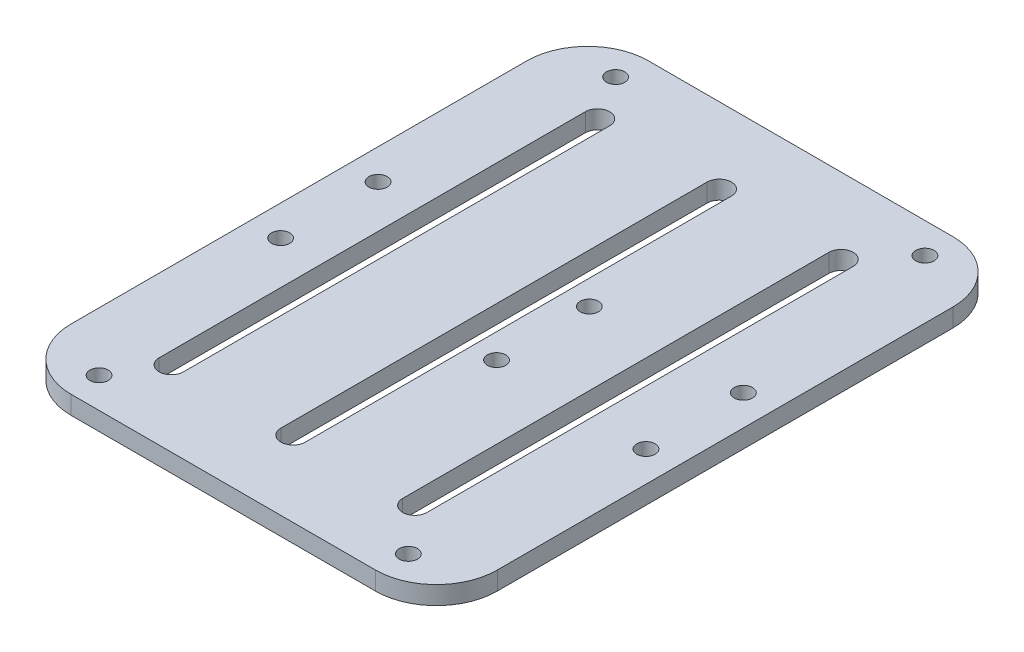
ISO-10303-21;
HEADER;
FILE_DESCRIPTION(('STEP AP214'),'2;1');
FILE_NAME('part.step','',(''),(''),'','','');
FILE_SCHEMA(('AUTOMOTIVE_DESIGN { 1 0 10303 214 1 1 1 1 }'));
ENDSEC;
DATA;
#1=APPLICATION_CONTEXT('core data for automotive mechanical design processes');
#2=APPLICATION_PROTOCOL_DEFINITION('international standard','automotive_design',2000,#1);
#3=PRODUCT_CONTEXT('',#1,'mechanical');
#4=PRODUCT('Part','Part','',(#3));
#5=PRODUCT_RELATED_PRODUCT_CATEGORY('part','',(#4));
#6=PRODUCT_DEFINITION_FORMATION('','',#4);
#7=PRODUCT_DEFINITION_CONTEXT('part definition',#1,'design');
#8=PRODUCT_DEFINITION('design','',#6,#7);
#9=PRODUCT_DEFINITION_SHAPE('','',#8);
#10=(LENGTH_UNIT() NAMED_UNIT(*) SI_UNIT(.MILLI.,.METRE.));
#11=(NAMED_UNIT(*) PLANE_ANGLE_UNIT() SI_UNIT($,.RADIAN.));
#12=(NAMED_UNIT(*) SI_UNIT($,.STERADIAN.) SOLID_ANGLE_UNIT());
#13=UNCERTAINTY_MEASURE_WITH_UNIT(LENGTH_MEASURE(1.E-05),#10,'distance_accuracy_value','');
#14=(GEOMETRIC_REPRESENTATION_CONTEXT(3) GLOBAL_UNCERTAINTY_ASSIGNED_CONTEXT((#13)) GLOBAL_UNIT_ASSIGNED_CONTEXT((#10,
#11,#12)) REPRESENTATION_CONTEXT('',''));
#15=CARTESIAN_POINT('',(0.,0.,0.));
#16=DIRECTION('',(0.,0.,1.));
#17=DIRECTION('',(1.,0.,0.));
#18=AXIS2_PLACEMENT_3D('',#15,#16,#17);
#19=CARTESIAN_POINT('',(-25.,3.,37.42));
#20=DIRECTION('',(0.,1.,0.));
#21=DIRECTION('',(0.,0.,1.));
#22=AXIS2_PLACEMENT_3D('',#19,#20,#21);
#23=PLANE('',#22);
#24=CARTESIAN_POINT('',(5.07999999999997,3.,7.62));
#25=DIRECTION('',(0.,1.,0.));
#26=DIRECTION('',(0.,0.,1.));
#27=AXIS2_PLACEMENT_3D('',#24,#25,#26);
#28=CIRCLE('',#27,1.5);
#29=CARTESIAN_POINT('',(5.07999999999997,3.,9.12));
#30=VERTEX_POINT('',#29);
#31=EDGE_CURVE('E212',#30,#30,#28,.T.);
#32=ORIENTED_EDGE('',*,*,#31,.F.);
#33=EDGE_LOOP('',(#32));
#34=FACE_BOUND('',#33,.T.);
#35=CARTESIAN_POINT('',(-25.4,3.,42.42));
#36=DIRECTION('',(0.,1.,0.));
#37=DIRECTION('',(0.,0.,1.));
#38=AXIS2_PLACEMENT_3D('',#35,#36,#37);
#39=CIRCLE('',#38,1.5);
#40=CARTESIAN_POINT('',(-25.4,3.,43.92));
#41=VERTEX_POINT('',#40);
#42=EDGE_CURVE('E322',#41,#41,#39,.T.);
#43=ORIENTED_EDGE('',*,*,#42,.F.);
#44=EDGE_LOOP('',(#43));
#45=FACE_BOUND('',#44,.T.);
#46=CARTESIAN_POINT('',(-25.4,3.,-42.42));
#47=DIRECTION('',(0.,1.,0.));
#48=DIRECTION('',(0.,0.,1.));
#49=AXIS2_PLACEMENT_3D('',#46,#47,#48);
#50=CIRCLE('',#49,1.5);
#51=CARTESIAN_POINT('',(-25.4,3.,-40.92));
#52=VERTEX_POINT('',#51);
#53=EDGE_CURVE('E338',#52,#52,#50,.T.);
#54=ORIENTED_EDGE('',*,*,#53,.F.);
#55=EDGE_LOOP('',(#54));
#56=FACE_BOUND('',#55,.T.);
#57=CARTESIAN_POINT('',(-30.,3.,8.));
#58=DIRECTION('',(0.,1.,0.));
#59=DIRECTION('',(0.,0.,1.));
#60=AXIS2_PLACEMENT_3D('',#57,#58,#59);
#61=CIRCLE('',#60,1.5);
#62=CARTESIAN_POINT('',(-30.,3.,9.5));
#63=VERTEX_POINT('',#62);
#64=EDGE_CURVE('E354',#63,#63,#61,.T.);
#65=ORIENTED_EDGE('',*,*,#64,.F.);
#66=EDGE_LOOP('',(#65));
#67=FACE_BOUND('',#66,.T.);
#68=CARTESIAN_POINT('',(-30.,3.,-8.));
#69=DIRECTION('',(0.,1.,0.));
#70=DIRECTION('',(0.,0.,1.));
#71=AXIS2_PLACEMENT_3D('',#68,#69,#70);
#72=CIRCLE('',#71,1.5);
#73=CARTESIAN_POINT('',(-30.,3.,-6.5));
#74=VERTEX_POINT('',#73);
#75=EDGE_CURVE('E370',#74,#74,#72,.T.);
#76=ORIENTED_EDGE('',*,*,#75,.F.);
#77=EDGE_LOOP('',(#76));
#78=FACE_BOUND('',#77,.T.);
#79=CARTESIAN_POINT('',(-25.,3.,37.42));
#80=DIRECTION('',(0.,1.,0.));
#81=DIRECTION('',(0.,0.,1.));
#82=AXIS2_PLACEMENT_3D('',#79,#80,#81);
#83=CIRCLE('',#82,10.);
#84=CARTESIAN_POINT('',(-35.,3.,37.4199999999999));
#85=VERTEX_POINT('',#84);
#86=CARTESIAN_POINT('',(-25.,3.,47.42));
#87=VERTEX_POINT('',#86);
#88=EDGE_CURVE('E378',#85,#87,#83,.T.);
#89=ORIENTED_EDGE('',*,*,#88,.T.);
#90=DIRECTION('',(1.,0.,0.));
#91=VECTOR('',#90,1.);
#92=CARTESIAN_POINT('',(-25.,3.,47.42));
#93=LINE('',#92,#91);
#94=CARTESIAN_POINT('',(24.9999999999999,3.,47.42));
#95=VERTEX_POINT('',#94);
#96=EDGE_CURVE('E382',#87,#95,#93,.T.);
#97=ORIENTED_EDGE('',*,*,#96,.T.);
#98=CARTESIAN_POINT('',(25.,3.,37.42));
#99=DIRECTION('',(0.,1.,0.));
#100=DIRECTION('',(0.,0.,1.));
#101=AXIS2_PLACEMENT_3D('',#98,#99,#100);
#102=CIRCLE('',#101,10.);
#103=CARTESIAN_POINT('',(35.,3.,37.4199999999999));
#104=VERTEX_POINT('',#103);
#105=EDGE_CURVE('E386',#95,#104,#102,.T.);
#106=ORIENTED_EDGE('',*,*,#105,.T.);
#107=DIRECTION('',(0.,0.,-1.));
#108=VECTOR('',#107,1.);
#109=CARTESIAN_POINT('',(35.,3.,-37.4199999999999));
#110=LINE('',#109,#108);
#111=CARTESIAN_POINT('',(35.,3.,-37.4199999999999));
#112=VERTEX_POINT('',#111);
#113=EDGE_CURVE('E389',#104,#112,#110,.T.);
#114=ORIENTED_EDGE('',*,*,#113,.T.);
#115=CARTESIAN_POINT('',(25.,3.,-37.42));
#116=DIRECTION('',(0.,1.,0.));
#117=DIRECTION('',(0.,0.,1.));
#118=AXIS2_PLACEMENT_3D('',#115,#116,#117);
#119=CIRCLE('',#118,10.);
#120=CARTESIAN_POINT('',(24.9999999999999,3.,-47.42));
#121=VERTEX_POINT('',#120);
#122=EDGE_CURVE('E392',#112,#121,#119,.T.);
#123=ORIENTED_EDGE('',*,*,#122,.T.);
#124=DIRECTION('',(-1.,0.,0.));
#125=VECTOR('',#124,1.);
#126=CARTESIAN_POINT('',(-25.,3.,-47.42));
#127=LINE('',#126,#125);
#128=CARTESIAN_POINT('',(-25.,3.,-47.42));
#129=VERTEX_POINT('',#128);
#130=EDGE_CURVE('E395',#121,#129,#127,.T.);
#131=ORIENTED_EDGE('',*,*,#130,.T.);
#132=CARTESIAN_POINT('',(-25.,3.,-37.42));
#133=DIRECTION('',(0.,1.,0.));
#134=DIRECTION('',(0.,0.,-1.));
#135=AXIS2_PLACEMENT_3D('',#132,#133,#134);
#136=CIRCLE('',#135,10.);
#137=CARTESIAN_POINT('',(-35.,3.,-37.4199999999999));
#138=VERTEX_POINT('',#137);
#139=EDGE_CURVE('E398',#129,#138,#136,.T.);
#140=ORIENTED_EDGE('',*,*,#139,.T.);
#141=DIRECTION('',(0.,0.,1.));
#142=VECTOR('',#141,1.);
#143=CARTESIAN_POINT('',(-35.,3.,-37.4199999999999));
#144=LINE('',#143,#142);
#145=EDGE_CURVE('E401',#138,#85,#144,.T.);
#146=ORIENTED_EDGE('',*,*,#145,.T.);
#147=EDGE_LOOP('',(#89,#97,#106,#114,#123,#131,#140,#146));
#148=FACE_BOUND('',#147,.T.);
#149=CARTESIAN_POINT('',(30.,3.,-8.));
#150=DIRECTION('',(0.,1.,0.));
#151=DIRECTION('',(0.,0.,1.));
#152=AXIS2_PLACEMENT_3D('',#149,#150,#151);
#153=CIRCLE('',#152,1.5);
#154=CARTESIAN_POINT('',(30.,3.,-6.5));
#155=VERTEX_POINT('',#154);
#156=EDGE_CURVE('E362',#155,#155,#153,.T.);
#157=ORIENTED_EDGE('',*,*,#156,.F.);
#158=EDGE_LOOP('',(#157));
#159=FACE_BOUND('',#158,.T.);
#160=CARTESIAN_POINT('',(30.,3.,8.));
#161=DIRECTION('',(0.,1.,0.));
#162=DIRECTION('',(0.,0.,1.));
#163=AXIS2_PLACEMENT_3D('',#160,#161,#162);
#164=CIRCLE('',#163,1.5);
#165=CARTESIAN_POINT('',(30.,3.,9.5));
#166=VERTEX_POINT('',#165);
#167=EDGE_CURVE('E346',#166,#166,#164,.T.);
#168=ORIENTED_EDGE('',*,*,#167,.F.);
#169=EDGE_LOOP('',(#168));
#170=FACE_BOUND('',#169,.T.);
#171=CARTESIAN_POINT('',(25.4,3.,-42.42));
#172=DIRECTION('',(0.,1.,0.));
#173=DIRECTION('',(0.,0.,1.));
#174=AXIS2_PLACEMENT_3D('',#171,#172,#173);
#175=CIRCLE('',#174,1.5);
#176=CARTESIAN_POINT('',(25.4,3.,-40.92));
#177=VERTEX_POINT('',#176);
#178=EDGE_CURVE('E330',#177,#177,#175,.T.);
#179=ORIENTED_EDGE('',*,*,#178,.F.);
#180=EDGE_LOOP('',(#179));
#181=FACE_BOUND('',#180,.T.);
#182=CARTESIAN_POINT('',(25.4,3.,42.42));
#183=DIRECTION('',(0.,1.,0.));
#184=DIRECTION('',(0.,0.,1.));
#185=AXIS2_PLACEMENT_3D('',#182,#183,#184);
#186=CIRCLE('',#185,1.5);
#187=CARTESIAN_POINT('',(25.4,3.,43.92));
#188=VERTEX_POINT('',#187);
#189=EDGE_CURVE('E314',#188,#188,#186,.T.);
#190=ORIENTED_EDGE('',*,*,#189,.F.);
#191=EDGE_LOOP('',(#190));
#192=FACE_BOUND('',#191,.T.);
#193=DIRECTION('',(0.,0.,-1.));
#194=VECTOR('',#193,1.);
#195=CARTESIAN_POINT('',(-18.957095709571,3.,35.));
#196=LINE('',#195,#194);
#197=CARTESIAN_POINT('',(-18.957095709571,3.,35.));
#198=VERTEX_POINT('',#197);
#199=CARTESIAN_POINT('',(-18.957095709571,3.,-35.));
#200=VERTEX_POINT('',#199);
#201=EDGE_CURVE('E274',#198,#200,#196,.T.);
#202=ORIENTED_EDGE('',*,*,#201,.F.);
#203=CARTESIAN_POINT('',(-20.957095709571,3.,35.));
#204=DIRECTION('',(0.,1.,0.));
#205=DIRECTION('',(0.,0.,1.));
#206=AXIS2_PLACEMENT_3D('',#203,#204,#205);
#207=CIRCLE('',#206,2.);
#208=CARTESIAN_POINT('',(-22.957095709571,3.,35.));
#209=VERTEX_POINT('',#208);
#210=EDGE_CURVE('E271',#209,#198,#207,.T.);
#211=ORIENTED_EDGE('',*,*,#210,.F.);
#212=DIRECTION('',(0.,0.,1.));
#213=VECTOR('',#212,1.);
#214=CARTESIAN_POINT('',(-22.957095709571,3.,35.));
#215=LINE('',#214,#213);
#216=CARTESIAN_POINT('',(-22.957095709571,3.,-35.));
#217=VERTEX_POINT('',#216);
#218=EDGE_CURVE('E282',#217,#209,#215,.T.);
#219=ORIENTED_EDGE('',*,*,#218,.F.);
#220=CARTESIAN_POINT('',(-20.957095709571,3.,-35.));
#221=DIRECTION('',(0.,1.,0.));
#222=DIRECTION('',(0.,0.,1.));
#223=AXIS2_PLACEMENT_3D('',#220,#221,#222);
#224=CIRCLE('',#223,2.);
#225=EDGE_CURVE('E278',#200,#217,#224,.T.);
#226=ORIENTED_EDGE('',*,*,#225,.F.);
#227=EDGE_LOOP('',(#202,#211,#219,#226));
#228=FACE_BOUND('',#227,.T.);
#229=DIRECTION('',(0.,0.,-1.));
#230=VECTOR('',#229,1.);
#231=CARTESIAN_POINT('',(1.04290429042901,3.,35.));
#232=LINE('',#231,#230);
#233=CARTESIAN_POINT('',(1.04290429042901,3.,35.));
#234=VERTEX_POINT('',#233);
#235=CARTESIAN_POINT('',(1.04290429042901,3.,-35.));
#236=VERTEX_POINT('',#235);
#237=EDGE_CURVE('E231',#234,#236,#232,.T.);
#238=ORIENTED_EDGE('',*,*,#237,.F.);
#239=CARTESIAN_POINT('',(-0.95709570957099,3.,35.));
#240=DIRECTION('',(0.,1.,0.));
#241=DIRECTION('',(0.,0.,1.));
#242=AXIS2_PLACEMENT_3D('',#239,#240,#241);
#243=CIRCLE('',#242,2.);
#244=CARTESIAN_POINT('',(-2.95709570957099,3.,35.));
#245=VERTEX_POINT('',#244);
#246=EDGE_CURVE('E228',#245,#234,#243,.T.);
#247=ORIENTED_EDGE('',*,*,#246,.F.);
#248=DIRECTION('',(0.,0.,1.));
#249=VECTOR('',#248,1.);
#250=CARTESIAN_POINT('',(-2.95709570957099,3.,35.));
#251=LINE('',#250,#249);
#252=CARTESIAN_POINT('',(-2.95709570957099,3.,-35.));
#253=VERTEX_POINT('',#252);
#254=EDGE_CURVE('E239',#253,#245,#251,.T.);
#255=ORIENTED_EDGE('',*,*,#254,.F.);
#256=CARTESIAN_POINT('',(-0.95709570957099,3.,-35.));
#257=DIRECTION('',(0.,1.,0.));
#258=DIRECTION('',(0.,0.,1.));
#259=AXIS2_PLACEMENT_3D('',#256,#257,#258);
#260=CIRCLE('',#259,2.);
#261=EDGE_CURVE('E235',#236,#253,#260,.T.);
#262=ORIENTED_EDGE('',*,*,#261,.F.);
#263=EDGE_LOOP('',(#238,#247,#255,#262));
#264=FACE_BOUND('',#263,.T.);
#265=DIRECTION('',(0.,0.,-1.));
#266=VECTOR('',#265,1.);
#267=CARTESIAN_POINT('',(21.042904290429,3.,35.));
#268=LINE('',#267,#266);
#269=CARTESIAN_POINT('',(21.042904290429,3.,35.));
#270=VERTEX_POINT('',#269);
#271=CARTESIAN_POINT('',(21.042904290429,3.,-35.));
#272=VERTEX_POINT('',#271);
#273=EDGE_CURVE('E186',#270,#272,#268,.T.);
#274=ORIENTED_EDGE('',*,*,#273,.F.);
#275=CARTESIAN_POINT('',(19.042904290429,3.,35.));
#276=DIRECTION('',(0.,1.,0.));
#277=DIRECTION('',(0.,0.,1.));
#278=AXIS2_PLACEMENT_3D('',#275,#276,#277);
#279=CIRCLE('',#278,2.);
#280=CARTESIAN_POINT('',(17.042904290429,3.,35.));
#281=VERTEX_POINT('',#280);
#282=EDGE_CURVE('E177',#281,#270,#279,.T.);
#283=ORIENTED_EDGE('',*,*,#282,.F.);
#284=DIRECTION('',(0.,0.,1.));
#285=VECTOR('',#284,1.);
#286=CARTESIAN_POINT('',(17.042904290429,3.,35.));
#287=LINE('',#286,#285);
#288=CARTESIAN_POINT('',(17.042904290429,3.,-35.));
#289=VERTEX_POINT('',#288);
#290=EDGE_CURVE('E204',#289,#281,#287,.T.);
#291=ORIENTED_EDGE('',*,*,#290,.F.);
#292=CARTESIAN_POINT('',(19.042904290429,3.,-35.));
#293=DIRECTION('',(0.,1.,0.));
#294=DIRECTION('',(0.,0.,1.));
#295=AXIS2_PLACEMENT_3D('',#292,#293,#294);
#296=CIRCLE('',#295,2.);
#297=EDGE_CURVE('E200',#272,#289,#296,.T.);
#298=ORIENTED_EDGE('',*,*,#297,.F.);
#299=EDGE_LOOP('',(#274,#283,#291,#298));
#300=FACE_BOUND('',#299,.T.);
#301=CARTESIAN_POINT('',(5.07999999999997,3.,-7.62));
#302=DIRECTION('',(0.,1.,0.));
#303=DIRECTION('',(0.,0.,-1.));
#304=AXIS2_PLACEMENT_3D('',#301,#302,#303);
#305=CIRCLE('',#304,1.5);
#306=CARTESIAN_POINT('',(5.07999999999997,3.,-9.12));
#307=VERTEX_POINT('',#306);
#308=EDGE_CURVE('E614',#307,#307,#305,.T.);
#309=ORIENTED_EDGE('',*,*,#308,.F.);
#310=EDGE_LOOP('',(#309));
#311=FACE_BOUND('',#310,.T.);
#312=ADVANCED_FACE('F39',(#34,#45,#56,#67,#78,#148,#159,#170,#181,#192,#228,#264,#300,#311),#23,.T.);
#313=CARTESIAN_POINT('',(-25.,0.,37.42));
#314=DIRECTION('',(0.,1.,0.));
#315=DIRECTION('',(0.,0.,1.));
#316=AXIS2_PLACEMENT_3D('',#313,#314,#315);
#317=PLANE('',#316);
#318=CARTESIAN_POINT('',(-0.95709570957099,0.,35.));
#319=DIRECTION('',(0.,1.,0.));
#320=DIRECTION('',(0.,0.,1.));
#321=AXIS2_PLACEMENT_3D('',#318,#319,#320);
#322=CIRCLE('',#321,2.);
#323=CARTESIAN_POINT('',(-2.95709570957099,0.,35.));
#324=VERTEX_POINT('',#323);
#325=CARTESIAN_POINT('',(1.04290429042901,0.,35.));
#326=VERTEX_POINT('',#325);
#327=EDGE_CURVE('E195',#324,#326,#322,.T.);
#328=ORIENTED_EDGE('',*,*,#327,.T.);
#329=DIRECTION('',(0.,0.,-1.));
#330=VECTOR('',#329,1.);
#331=CARTESIAN_POINT('',(1.04290429042901,0.,35.));
#332=LINE('',#331,#330);
#333=CARTESIAN_POINT('',(1.04290429042901,0.,-35.));
#334=VERTEX_POINT('',#333);
#335=EDGE_CURVE('E246',#326,#334,#332,.T.);
#336=ORIENTED_EDGE('',*,*,#335,.T.);
#337=CARTESIAN_POINT('',(-0.95709570957099,0.,-35.));
#338=DIRECTION('',(0.,1.,0.));
#339=DIRECTION('',(0.,0.,1.));
#340=AXIS2_PLACEMENT_3D('',#337,#338,#339);
#341=CIRCLE('',#340,2.);
#342=CARTESIAN_POINT('',(-2.95709570957099,0.,-35.));
#343=VERTEX_POINT('',#342);
#344=EDGE_CURVE('E250',#334,#343,#341,.T.);
#345=ORIENTED_EDGE('',*,*,#344,.T.);
#346=DIRECTION('',(0.,0.,1.));
#347=VECTOR('',#346,1.);
#348=CARTESIAN_POINT('',(-2.95709570957099,0.,35.));
#349=LINE('',#348,#347);
#350=EDGE_CURVE('E232',#343,#324,#349,.T.);
#351=ORIENTED_EDGE('',*,*,#350,.T.);
#352=EDGE_LOOP('',(#328,#336,#345,#351));
#353=FACE_BOUND('',#352,.T.);
#354=CARTESIAN_POINT('',(25.4,0.,42.42));
#355=DIRECTION('',(0.,1.,0.));
#356=DIRECTION('',(0.,0.,1.));
#357=AXIS2_PLACEMENT_3D('',#354,#355,#356);
#358=CIRCLE('',#357,1.5);
#359=CARTESIAN_POINT('',(25.4,0.,43.92));
#360=VERTEX_POINT('',#359);
#361=EDGE_CURVE('E313',#360,#360,#358,.T.);
#362=ORIENTED_EDGE('',*,*,#361,.T.);
#363=EDGE_LOOP('',(#362));
#364=FACE_BOUND('',#363,.T.);
#365=CARTESIAN_POINT('',(-25.4,0.,42.42));
#366=DIRECTION('',(0.,1.,0.));
#367=DIRECTION('',(0.,0.,1.));
#368=AXIS2_PLACEMENT_3D('',#365,#366,#367);
#369=CIRCLE('',#368,1.5);
#370=CARTESIAN_POINT('',(-25.4,0.,43.92));
#371=VERTEX_POINT('',#370);
#372=EDGE_CURVE('E318',#371,#371,#369,.T.);
#373=ORIENTED_EDGE('',*,*,#372,.T.);
#374=EDGE_LOOP('',(#373));
#375=FACE_BOUND('',#374,.T.);
#376=CARTESIAN_POINT('',(25.4,0.,-42.42));
#377=DIRECTION('',(0.,1.,0.));
#378=DIRECTION('',(0.,0.,1.));
#379=AXIS2_PLACEMENT_3D('',#376,#377,#378);
#380=CIRCLE('',#379,1.5);
#381=CARTESIAN_POINT('',(25.4,0.,-40.92));
#382=VERTEX_POINT('',#381);
#383=EDGE_CURVE('E326',#382,#382,#380,.T.);
#384=ORIENTED_EDGE('',*,*,#383,.T.);
#385=EDGE_LOOP('',(#384));
#386=FACE_BOUND('',#385,.T.);
#387=CARTESIAN_POINT('',(-25.4,0.,-42.42));
#388=DIRECTION('',(0.,1.,0.));
#389=DIRECTION('',(0.,0.,1.));
#390=AXIS2_PLACEMENT_3D('',#387,#388,#389);
#391=CIRCLE('',#390,1.5);
#392=CARTESIAN_POINT('',(-25.4,0.,-40.92));
#393=VERTEX_POINT('',#392);
#394=EDGE_CURVE('E334',#393,#393,#391,.T.);
#395=ORIENTED_EDGE('',*,*,#394,.T.);
#396=EDGE_LOOP('',(#395));
#397=FACE_BOUND('',#396,.T.);
#398=CARTESIAN_POINT('',(30.,0.,8.));
#399=DIRECTION('',(0.,1.,0.));
#400=DIRECTION('',(0.,0.,1.));
#401=AXIS2_PLACEMENT_3D('',#398,#399,#400);
#402=CIRCLE('',#401,1.5);
#403=CARTESIAN_POINT('',(30.,0.,9.5));
#404=VERTEX_POINT('',#403);
#405=EDGE_CURVE('E342',#404,#404,#402,.T.);
#406=ORIENTED_EDGE('',*,*,#405,.T.);
#407=EDGE_LOOP('',(#406));
#408=FACE_BOUND('',#407,.T.);
#409=CARTESIAN_POINT('',(-30.,0.,8.));
#410=DIRECTION('',(0.,1.,0.));
#411=DIRECTION('',(0.,0.,1.));
#412=AXIS2_PLACEMENT_3D('',#409,#410,#411);
#413=CIRCLE('',#412,1.5);
#414=CARTESIAN_POINT('',(-30.,0.,9.5));
#415=VERTEX_POINT('',#414);
#416=EDGE_CURVE('E350',#415,#415,#413,.T.);
#417=ORIENTED_EDGE('',*,*,#416,.T.);
#418=EDGE_LOOP('',(#417));
#419=FACE_BOUND('',#418,.T.);
#420=CARTESIAN_POINT('',(30.,0.,-8.));
#421=DIRECTION('',(0.,1.,0.));
#422=DIRECTION('',(0.,0.,1.));
#423=AXIS2_PLACEMENT_3D('',#420,#421,#422);
#424=CIRCLE('',#423,1.5);
#425=CARTESIAN_POINT('',(30.,0.,-6.5));
#426=VERTEX_POINT('',#425);
#427=EDGE_CURVE('E358',#426,#426,#424,.T.);
#428=ORIENTED_EDGE('',*,*,#427,.T.);
#429=EDGE_LOOP('',(#428));
#430=FACE_BOUND('',#429,.T.);
#431=CARTESIAN_POINT('',(-30.,0.,-8.));
#432=DIRECTION('',(0.,1.,0.));
#433=DIRECTION('',(0.,0.,1.));
#434=AXIS2_PLACEMENT_3D('',#431,#432,#433);
#435=CIRCLE('',#434,1.5);
#436=CARTESIAN_POINT('',(-30.,0.,-6.5));
#437=VERTEX_POINT('',#436);
#438=EDGE_CURVE('E366',#437,#437,#435,.T.);
#439=ORIENTED_EDGE('',*,*,#438,.T.);
#440=EDGE_LOOP('',(#439));
#441=FACE_BOUND('',#440,.T.);
#442=CARTESIAN_POINT('',(-25.,0.,37.42));
#443=DIRECTION('',(0.,1.,0.));
#444=DIRECTION('',(0.,0.,1.));
#445=AXIS2_PLACEMENT_3D('',#442,#443,#444);
#446=CIRCLE('',#445,10.);
#447=CARTESIAN_POINT('',(-35.,0.,37.4199999999999));
#448=VERTEX_POINT('',#447);
#449=CARTESIAN_POINT('',(-25.,0.,47.42));
#450=VERTEX_POINT('',#449);
#451=EDGE_CURVE('E374',#448,#450,#446,.T.);
#452=ORIENTED_EDGE('',*,*,#451,.F.);
#453=DIRECTION('',(0.,0.,1.));
#454=VECTOR('',#453,1.);
#455=CARTESIAN_POINT('',(-35.,0.,-37.4199999999999));
#456=LINE('',#455,#454);
#457=CARTESIAN_POINT('',(-35.,0.,-37.4199999999999));
#458=VERTEX_POINT('',#457);
#459=EDGE_CURVE('E383',#458,#448,#456,.T.);
#460=ORIENTED_EDGE('',*,*,#459,.F.);
#461=CARTESIAN_POINT('',(-25.,0.,-37.42));
#462=DIRECTION('',(0.,1.,0.));
#463=DIRECTION('',(0.,0.,-1.));
#464=AXIS2_PLACEMENT_3D('',#461,#462,#463);
#465=CIRCLE('',#464,10.);
#466=CARTESIAN_POINT('',(-25.,0.,-47.42));
#467=VERTEX_POINT('',#466);
#468=EDGE_CURVE('E423',#467,#458,#465,.T.);
#469=ORIENTED_EDGE('',*,*,#468,.F.);
#470=DIRECTION('',(-1.,0.,0.));
#471=VECTOR('',#470,1.);
#472=CARTESIAN_POINT('',(-25.,0.,-47.42));
#473=LINE('',#472,#471);
#474=CARTESIAN_POINT('',(24.9999999999999,0.,-47.42));
#475=VERTEX_POINT('',#474);
#476=EDGE_CURVE('E420',#475,#467,#473,.T.);
#477=ORIENTED_EDGE('',*,*,#476,.F.);
#478=CARTESIAN_POINT('',(25.,0.,-37.42));
#479=DIRECTION('',(0.,1.,0.));
#480=DIRECTION('',(0.,0.,1.));
#481=AXIS2_PLACEMENT_3D('',#478,#479,#480);
#482=CIRCLE('',#481,10.);
#483=CARTESIAN_POINT('',(35.,0.,-37.4199999999999));
#484=VERTEX_POINT('',#483);
#485=EDGE_CURVE('E417',#484,#475,#482,.T.);
#486=ORIENTED_EDGE('',*,*,#485,.F.);
#487=DIRECTION('',(0.,0.,-1.));
#488=VECTOR('',#487,1.);
#489=CARTESIAN_POINT('',(35.,0.,-37.4199999999999));
#490=LINE('',#489,#488);
#491=CARTESIAN_POINT('',(35.,0.,37.4199999999999));
#492=VERTEX_POINT('',#491);
#493=EDGE_CURVE('E414',#492,#484,#490,.T.);
#494=ORIENTED_EDGE('',*,*,#493,.F.);
#495=CARTESIAN_POINT('',(25.,0.,37.42));
#496=DIRECTION('',(0.,1.,0.));
#497=DIRECTION('',(0.,0.,1.));
#498=AXIS2_PLACEMENT_3D('',#495,#496,#497);
#499=CIRCLE('',#498,10.);
#500=CARTESIAN_POINT('',(24.9999999999999,0.,47.42));
#501=VERTEX_POINT('',#500);
#502=EDGE_CURVE('E411',#501,#492,#499,.T.);
#503=ORIENTED_EDGE('',*,*,#502,.F.);
#504=DIRECTION('',(1.,0.,0.));
#505=VECTOR('',#504,1.);
#506=CARTESIAN_POINT('',(-25.,0.,47.42));
#507=LINE('',#506,#505);
#508=EDGE_CURVE('E408',#450,#501,#507,.T.);
#509=ORIENTED_EDGE('',*,*,#508,.F.);
#510=EDGE_LOOP('',(#452,#460,#469,#477,#486,#494,#503,#509));
#511=FACE_BOUND('',#510,.T.);
#512=CARTESIAN_POINT('',(-20.957095709571,0.,35.));
#513=DIRECTION('',(0.,1.,0.));
#514=DIRECTION('',(0.,0.,1.));
#515=AXIS2_PLACEMENT_3D('',#512,#513,#514);
#516=CIRCLE('',#515,2.);
#517=CARTESIAN_POINT('',(-22.957095709571,0.,35.));
#518=VERTEX_POINT('',#517);
#519=CARTESIAN_POINT('',(-18.957095709571,0.,35.));
#520=VERTEX_POINT('',#519);
#521=EDGE_CURVE('E270',#518,#520,#516,.T.);
#522=ORIENTED_EDGE('',*,*,#521,.T.);
#523=DIRECTION('',(0.,0.,-1.));
#524=VECTOR('',#523,1.);
#525=CARTESIAN_POINT('',(-18.957095709571,0.,35.));
#526=LINE('',#525,#524);
#527=CARTESIAN_POINT('',(-18.957095709571,0.,-35.));
#528=VERTEX_POINT('',#527);
#529=EDGE_CURVE('E289',#520,#528,#526,.T.);
#530=ORIENTED_EDGE('',*,*,#529,.T.);
#531=CARTESIAN_POINT('',(-20.957095709571,0.,-35.));
#532=DIRECTION('',(0.,1.,0.));
#533=DIRECTION('',(0.,0.,1.));
#534=AXIS2_PLACEMENT_3D('',#531,#532,#533);
#535=CIRCLE('',#534,2.);
#536=CARTESIAN_POINT('',(-22.957095709571,0.,-35.));
#537=VERTEX_POINT('',#536);
#538=EDGE_CURVE('E293',#528,#537,#535,.T.);
#539=ORIENTED_EDGE('',*,*,#538,.T.);
#540=DIRECTION('',(0.,0.,1.));
#541=VECTOR('',#540,1.);
#542=CARTESIAN_POINT('',(-22.957095709571,0.,35.));
#543=LINE('',#542,#541);
#544=EDGE_CURVE('E275',#537,#518,#543,.T.);
#545=ORIENTED_EDGE('',*,*,#544,.T.);
#546=EDGE_LOOP('',(#522,#530,#539,#545));
#547=FACE_BOUND('',#546,.T.);
#548=CARTESIAN_POINT('',(19.042904290429,0.,35.));
#549=DIRECTION('',(0.,1.,0.));
#550=DIRECTION('',(0.,0.,1.));
#551=AXIS2_PLACEMENT_3D('',#548,#549,#550);
#552=CIRCLE('',#551,2.);
#553=CARTESIAN_POINT('',(17.042904290429,0.,35.));
#554=VERTEX_POINT('',#553);
#555=CARTESIAN_POINT('',(21.042904290429,0.,35.));
#556=VERTEX_POINT('',#555);
#557=EDGE_CURVE('E63',#554,#556,#552,.T.);
#558=ORIENTED_EDGE('',*,*,#557,.T.);
#559=DIRECTION('',(0.,0.,-1.));
#560=VECTOR('',#559,1.);
#561=CARTESIAN_POINT('',(21.042904290429,0.,35.));
#562=LINE('',#561,#560);
#563=CARTESIAN_POINT('',(21.042904290429,0.,-35.));
#564=VERTEX_POINT('',#563);
#565=EDGE_CURVE('E193',#556,#564,#562,.T.);
#566=ORIENTED_EDGE('',*,*,#565,.T.);
#567=CARTESIAN_POINT('',(19.042904290429,0.,-35.));
#568=DIRECTION('',(0.,1.,0.));
#569=DIRECTION('',(0.,0.,1.));
#570=AXIS2_PLACEMENT_3D('',#567,#568,#569);
#571=CIRCLE('',#570,2.);
#572=CARTESIAN_POINT('',(17.042904290429,0.,-35.));
#573=VERTEX_POINT('',#572);
#574=EDGE_CURVE('E215',#564,#573,#571,.T.);
#575=ORIENTED_EDGE('',*,*,#574,.T.);
#576=DIRECTION('',(0.,0.,1.));
#577=VECTOR('',#576,1.);
#578=CARTESIAN_POINT('',(17.042904290429,0.,35.));
#579=LINE('',#578,#577);
#580=EDGE_CURVE('E187',#573,#554,#579,.T.);
#581=ORIENTED_EDGE('',*,*,#580,.T.);
#582=EDGE_LOOP('',(#558,#566,#575,#581));
#583=FACE_BOUND('',#582,.T.);
#584=CARTESIAN_POINT('',(5.07999999999997,0.,7.62));
#585=DIRECTION('',(0.,1.,0.));
#586=DIRECTION('',(0.,0.,1.));
#587=AXIS2_PLACEMENT_3D('',#584,#585,#586);
#588=CIRCLE('',#587,1.5);
#589=CARTESIAN_POINT('',(5.07999999999997,0.,9.12));
#590=VERTEX_POINT('',#589);
#591=EDGE_CURVE('E622',#590,#590,#588,.T.);
#592=ORIENTED_EDGE('',*,*,#591,.T.);
#593=EDGE_LOOP('',(#592));
#594=FACE_BOUND('',#593,.T.);
#595=CARTESIAN_POINT('',(5.07999999999997,0.,-7.62));
#596=DIRECTION('',(0.,1.,0.));
#597=DIRECTION('',(0.,0.,-1.));
#598=AXIS2_PLACEMENT_3D('',#595,#596,#597);
#599=CIRCLE('',#598,1.5);
#600=CARTESIAN_POINT('',(5.07999999999997,0.,-9.12));
#601=VERTEX_POINT('',#600);
#602=EDGE_CURVE('E617',#601,#601,#599,.T.);
#603=ORIENTED_EDGE('',*,*,#602,.T.);
#604=EDGE_LOOP('',(#603));
#605=FACE_BOUND('',#604,.T.);
#606=ADVANCED_FACE('F462',(#353,#364,#375,#386,#397,#408,#419,#430,#441,#511,#547,#583,#594,
#605),#317,.F.);
#607=CARTESIAN_POINT('',(-25.,3.,37.42));
#608=DIRECTION('',(0.,-1.,0.));
#609=DIRECTION('',(0.,0.,-1.));
#610=AXIS2_PLACEMENT_3D('',#607,#608,#609);
#611=CYLINDRICAL_SURFACE('',#610,10.);
#612=ORIENTED_EDGE('',*,*,#451,.T.);
#613=DIRECTION('',(0.,-1.,0.));
#614=VECTOR('',#613,1.);
#615=CARTESIAN_POINT('',(-25.,3.,47.42));
#616=LINE('',#615,#614);
#617=EDGE_CURVE('E11',#87,#450,#616,.T.);
#618=ORIENTED_EDGE('',*,*,#617,.F.);
#619=ORIENTED_EDGE('',*,*,#88,.F.);
#620=DIRECTION('',(0.,-1.,0.));
#621=VECTOR('',#620,1.);
#622=CARTESIAN_POINT('',(-35.,3.,37.4199999999999));
#623=LINE('',#622,#621);
#624=EDGE_CURVE('E404',#85,#448,#623,.T.);
#625=ORIENTED_EDGE('',*,*,#624,.T.);
#626=EDGE_LOOP('',(#612,#618,#619,#625));
#627=FACE_BOUND('',#626,.T.);
#628=ADVANCED_FACE('F41',(#627),#611,.T.);
#629=CARTESIAN_POINT('',(-25.,3.,47.42));
#630=DIRECTION('',(0.,0.,-1.));
#631=DIRECTION('',(-1.,0.,0.));
#632=AXIS2_PLACEMENT_3D('',#629,#630,#631);
#633=PLANE('',#632);
#634=ORIENTED_EDGE('',*,*,#508,.T.);
#635=DIRECTION('',(0.,-1.,0.));
#636=VECTOR('',#635,1.);
#637=CARTESIAN_POINT('',(24.9999999999999,3.,47.42));
#638=LINE('',#637,#636);
#639=EDGE_CURVE('E48',#95,#501,#638,.T.);
#640=ORIENTED_EDGE('',*,*,#639,.F.);
#641=ORIENTED_EDGE('',*,*,#96,.F.);
#642=ORIENTED_EDGE('',*,*,#617,.T.);
#643=EDGE_LOOP('',(#634,#640,#641,#642));
#644=FACE_BOUND('',#643,.T.);
#645=ADVANCED_FACE('F480',(#644),#633,.F.);
#646=CARTESIAN_POINT('',(25.,3.,37.42));
#647=DIRECTION('',(0.,-1.,0.));
#648=DIRECTION('',(0.,0.,-1.));
#649=AXIS2_PLACEMENT_3D('',#646,#647,#648);
#650=CYLINDRICAL_SURFACE('',#649,10.);
#651=ORIENTED_EDGE('',*,*,#502,.T.);
#652=DIRECTION('',(0.,-1.,0.));
#653=VECTOR('',#652,1.);
#654=CARTESIAN_POINT('',(35.,3.,37.4199999999999));
#655=LINE('',#654,#653);
#656=EDGE_CURVE('E447',#104,#492,#655,.T.);
#657=ORIENTED_EDGE('',*,*,#656,.F.);
#658=ORIENTED_EDGE('',*,*,#105,.F.);
#659=ORIENTED_EDGE('',*,*,#639,.T.);
#660=EDGE_LOOP('',(#651,#657,#658,#659));
#661=FACE_BOUND('',#660,.T.);
#662=ADVANCED_FACE('F456',(#661),#650,.T.);
#663=CARTESIAN_POINT('',(35.,3.,-37.4199999999999));
#664=DIRECTION('',(-1.,0.,0.));
#665=DIRECTION('',(0.,0.,1.));
#666=AXIS2_PLACEMENT_3D('',#663,#664,#665);
#667=PLANE('',#666);
#668=ORIENTED_EDGE('',*,*,#493,.T.);
#669=DIRECTION('',(0.,-1.,0.));
#670=VECTOR('',#669,1.);
#671=CARTESIAN_POINT('',(35.,3.,-37.4199999999999));
#672=LINE('',#671,#670);
#673=EDGE_CURVE('E443',#112,#484,#672,.T.);
#674=ORIENTED_EDGE('',*,*,#673,.F.);
#675=ORIENTED_EDGE('',*,*,#113,.F.);
#676=ORIENTED_EDGE('',*,*,#656,.T.);
#677=EDGE_LOOP('',(#668,#674,#675,#676));
#678=FACE_BOUND('',#677,.T.);
#679=ADVANCED_FACE('F468',(#678),#667,.F.);
#680=CARTESIAN_POINT('',(25.,3.,-37.42));
#681=DIRECTION('',(0.,-1.,0.));
#682=DIRECTION('',(0.,0.,-1.));
#683=AXIS2_PLACEMENT_3D('',#680,#681,#682);
#684=CYLINDRICAL_SURFACE('',#683,10.);
#685=ORIENTED_EDGE('',*,*,#485,.T.);
#686=DIRECTION('',(0.,-1.,0.));
#687=VECTOR('',#686,1.);
#688=CARTESIAN_POINT('',(24.9999999999999,3.,-47.42));
#689=LINE('',#688,#687);
#690=EDGE_CURVE('E439',#121,#475,#689,.T.);
#691=ORIENTED_EDGE('',*,*,#690,.F.);
#692=ORIENTED_EDGE('',*,*,#122,.F.);
#693=ORIENTED_EDGE('',*,*,#673,.T.);
#694=EDGE_LOOP('',(#685,#691,#692,#693));
#695=FACE_BOUND('',#694,.T.);
#696=ADVANCED_FACE('F472',(#695),#684,.T.);
#697=CARTESIAN_POINT('',(-25.,3.,-47.42));
#698=DIRECTION('',(0.,0.,1.));
#699=DIRECTION('',(1.,0.,0.));
#700=AXIS2_PLACEMENT_3D('',#697,#698,#699);
#701=PLANE('',#700);
#702=ORIENTED_EDGE('',*,*,#476,.T.);
#703=DIRECTION('',(0.,-1.,0.));
#704=VECTOR('',#703,1.);
#705=CARTESIAN_POINT('',(-25.,3.,-47.42));
#706=LINE('',#705,#704);
#707=EDGE_CURVE('E435',#129,#467,#706,.T.);
#708=ORIENTED_EDGE('',*,*,#707,.F.);
#709=ORIENTED_EDGE('',*,*,#130,.F.);
#710=ORIENTED_EDGE('',*,*,#690,.T.);
#711=EDGE_LOOP('',(#702,#708,#709,#710));
#712=FACE_BOUND('',#711,.T.);
#713=ADVANCED_FACE('F493',(#712),#701,.F.);
#714=CARTESIAN_POINT('',(-25.,3.,-37.42));
#715=DIRECTION('',(0.,-1.,0.));
#716=DIRECTION('',(0.,0.,-1.));
#717=AXIS2_PLACEMENT_3D('',#714,#715,#716);
#718=CYLINDRICAL_SURFACE('',#717,10.);
#719=ORIENTED_EDGE('',*,*,#468,.T.);
#720=DIRECTION('',(0.,-1.,0.));
#721=VECTOR('',#720,1.);
#722=CARTESIAN_POINT('',(-35.,3.,-37.4199999999999));
#723=LINE('',#722,#721);
#724=EDGE_CURVE('E431',#138,#458,#723,.T.);
#725=ORIENTED_EDGE('',*,*,#724,.F.);
#726=ORIENTED_EDGE('',*,*,#139,.F.);
#727=ORIENTED_EDGE('',*,*,#707,.T.);
#728=EDGE_LOOP('',(#719,#725,#726,#727));
#729=FACE_BOUND('',#728,.T.);
#730=ADVANCED_FACE('F491',(#729),#718,.T.);
#731=CARTESIAN_POINT('',(-35.,3.,-37.4199999999999));
#732=DIRECTION('',(1.,0.,0.));
#733=DIRECTION('',(0.,0.,-1.));
#734=AXIS2_PLACEMENT_3D('',#731,#732,#733);
#735=PLANE('',#734);
#736=ORIENTED_EDGE('',*,*,#459,.T.);
#737=ORIENTED_EDGE('',*,*,#624,.F.);
#738=ORIENTED_EDGE('',*,*,#145,.F.);
#739=ORIENTED_EDGE('',*,*,#724,.T.);
#740=EDGE_LOOP('',(#736,#737,#738,#739));
#741=FACE_BOUND('',#740,.T.);
#742=ADVANCED_FACE('F486',(#741),#735,.F.);
#743=CARTESIAN_POINT('',(-30.,3.,-8.));
#744=DIRECTION('',(0.,-1.,0.));
#745=DIRECTION('',(0.,0.,-1.));
#746=AXIS2_PLACEMENT_3D('',#743,#744,#745);
#747=CYLINDRICAL_SURFACE('',#746,1.5);
#748=ORIENTED_EDGE('',*,*,#75,.T.);
#749=EDGE_LOOP('',(#748));
#750=FACE_BOUND('',#749,.T.);
#751=ORIENTED_EDGE('',*,*,#438,.F.);
#752=EDGE_LOOP('',(#751));
#753=FACE_BOUND('',#752,.T.);
#754=ADVANCED_FACE('F513',(#750,#753),#747,.F.);
#755=CARTESIAN_POINT('',(30.,3.,-8.));
#756=DIRECTION('',(0.,-1.,0.));
#757=DIRECTION('',(0.,0.,-1.));
#758=AXIS2_PLACEMENT_3D('',#755,#756,#757);
#759=CYLINDRICAL_SURFACE('',#758,1.5);
#760=ORIENTED_EDGE('',*,*,#156,.T.);
#761=EDGE_LOOP('',(#760));
#762=FACE_BOUND('',#761,.T.);
#763=ORIENTED_EDGE('',*,*,#427,.F.);
#764=EDGE_LOOP('',(#763));
#765=FACE_BOUND('',#764,.T.);
#766=ADVANCED_FACE('F520',(#762,#765),#759,.F.);
#767=CARTESIAN_POINT('',(-30.,3.,8.));
#768=DIRECTION('',(0.,-1.,0.));
#769=DIRECTION('',(0.,0.,-1.));
#770=AXIS2_PLACEMENT_3D('',#767,#768,#769);
#771=CYLINDRICAL_SURFACE('',#770,1.5);
#772=ORIENTED_EDGE('',*,*,#64,.T.);
#773=EDGE_LOOP('',(#772));
#774=FACE_BOUND('',#773,.T.);
#775=ORIENTED_EDGE('',*,*,#416,.F.);
#776=EDGE_LOOP('',(#775));
#777=FACE_BOUND('',#776,.T.);
#778=ADVANCED_FACE('F525',(#774,#777),#771,.F.);
#779=CARTESIAN_POINT('',(30.,3.,8.));
#780=DIRECTION('',(0.,-1.,0.));
#781=DIRECTION('',(0.,0.,-1.));
#782=AXIS2_PLACEMENT_3D('',#779,#780,#781);
#783=CYLINDRICAL_SURFACE('',#782,1.5);
#784=ORIENTED_EDGE('',*,*,#167,.T.);
#785=EDGE_LOOP('',(#784));
#786=FACE_BOUND('',#785,.T.);
#787=ORIENTED_EDGE('',*,*,#405,.F.);
#788=EDGE_LOOP('',(#787));
#789=FACE_BOUND('',#788,.T.);
#790=ADVANCED_FACE('F535',(#786,#789),#783,.F.);
#791=CARTESIAN_POINT('',(-25.4,3.,-42.42));
#792=DIRECTION('',(0.,-1.,0.));
#793=DIRECTION('',(0.,0.,-1.));
#794=AXIS2_PLACEMENT_3D('',#791,#792,#793);
#795=CYLINDRICAL_SURFACE('',#794,1.5);
#796=ORIENTED_EDGE('',*,*,#53,.T.);
#797=EDGE_LOOP('',(#796));
#798=FACE_BOUND('',#797,.T.);
#799=ORIENTED_EDGE('',*,*,#394,.F.);
#800=EDGE_LOOP('',(#799));
#801=FACE_BOUND('',#800,.T.);
#802=ADVANCED_FACE('F542',(#798,#801),#795,.F.);
#803=CARTESIAN_POINT('',(25.4,3.,-42.42));
#804=DIRECTION('',(0.,-1.,0.));
#805=DIRECTION('',(0.,0.,-1.));
#806=AXIS2_PLACEMENT_3D('',#803,#804,#805);
#807=CYLINDRICAL_SURFACE('',#806,1.5);
#808=ORIENTED_EDGE('',*,*,#178,.T.);
#809=EDGE_LOOP('',(#808));
#810=FACE_BOUND('',#809,.T.);
#811=ORIENTED_EDGE('',*,*,#383,.F.);
#812=EDGE_LOOP('',(#811));
#813=FACE_BOUND('',#812,.T.);
#814=ADVANCED_FACE('F546',(#810,#813),#807,.F.);
#815=CARTESIAN_POINT('',(-25.4,3.,42.42));
#816=DIRECTION('',(0.,-1.,0.));
#817=DIRECTION('',(0.,0.,-1.));
#818=AXIS2_PLACEMENT_3D('',#815,#816,#817);
#819=CYLINDRICAL_SURFACE('',#818,1.5);
#820=ORIENTED_EDGE('',*,*,#42,.T.);
#821=EDGE_LOOP('',(#820));
#822=FACE_BOUND('',#821,.T.);
#823=ORIENTED_EDGE('',*,*,#372,.F.);
#824=EDGE_LOOP('',(#823));
#825=FACE_BOUND('',#824,.T.);
#826=ADVANCED_FACE('F550',(#822,#825),#819,.F.);
#827=CARTESIAN_POINT('',(25.4,3.,42.42));
#828=DIRECTION('',(0.,-1.,0.));
#829=DIRECTION('',(0.,0.,-1.));
#830=AXIS2_PLACEMENT_3D('',#827,#828,#829);
#831=CYLINDRICAL_SURFACE('',#830,1.5);
#832=ORIENTED_EDGE('',*,*,#189,.T.);
#833=EDGE_LOOP('',(#832));
#834=FACE_BOUND('',#833,.T.);
#835=ORIENTED_EDGE('',*,*,#361,.F.);
#836=EDGE_LOOP('',(#835));
#837=FACE_BOUND('',#836,.T.);
#838=ADVANCED_FACE('F554',(#834,#837),#831,.F.);
#839=CARTESIAN_POINT('',(-20.957095709571,3.,35.));
#840=DIRECTION('',(0.,-1.,0.));
#841=DIRECTION('',(0.,0.,-1.));
#842=AXIS2_PLACEMENT_3D('',#839,#840,#841);
#843=CYLINDRICAL_SURFACE('',#842,2.);
#844=ORIENTED_EDGE('',*,*,#521,.F.);
#845=DIRECTION('',(0.,-1.,0.));
#846=VECTOR('',#845,1.);
#847=CARTESIAN_POINT('',(-22.957095709571,3.,35.));
#848=LINE('',#847,#846);
#849=EDGE_CURVE('E285',#209,#518,#848,.T.);
#850=ORIENTED_EDGE('',*,*,#849,.F.);
#851=ORIENTED_EDGE('',*,*,#210,.T.);
#852=DIRECTION('',(0.,-1.,0.));
#853=VECTOR('',#852,1.);
#854=CARTESIAN_POINT('',(-18.957095709571,3.,35.));
#855=LINE('',#854,#853);
#856=EDGE_CURVE('E309',#198,#520,#855,.T.);
#857=ORIENTED_EDGE('',*,*,#856,.T.);
#858=EDGE_LOOP('',(#844,#850,#851,#857));
#859=FACE_BOUND('',#858,.T.);
#860=ADVANCED_FACE('F558',(#859),#843,.F.);
#861=CARTESIAN_POINT('',(-18.957095709571,3.,35.));
#862=DIRECTION('',(-1.,0.,0.));
#863=DIRECTION('',(0.,0.,1.));
#864=AXIS2_PLACEMENT_3D('',#861,#862,#863);
#865=PLANE('',#864);
#866=ORIENTED_EDGE('',*,*,#529,.F.);
#867=ORIENTED_EDGE('',*,*,#856,.F.);
#868=ORIENTED_EDGE('',*,*,#201,.T.);
#869=DIRECTION('',(0.,-1.,0.));
#870=VECTOR('',#869,1.);
#871=CARTESIAN_POINT('',(-18.957095709571,3.,-35.));
#872=LINE('',#871,#870);
#873=EDGE_CURVE('E306',#200,#528,#872,.T.);
#874=ORIENTED_EDGE('',*,*,#873,.T.);
#875=EDGE_LOOP('',(#866,#867,#868,#874));
#876=FACE_BOUND('',#875,.T.);
#877=ADVANCED_FACE('F562',(#876),#865,.T.);
#878=CARTESIAN_POINT('',(-20.957095709571,3.,-35.));
#879=DIRECTION('',(0.,-1.,0.));
#880=DIRECTION('',(0.,0.,-1.));
#881=AXIS2_PLACEMENT_3D('',#878,#879,#880);
#882=CYLINDRICAL_SURFACE('',#881,2.);
#883=ORIENTED_EDGE('',*,*,#538,.F.);
#884=ORIENTED_EDGE('',*,*,#873,.F.);
#885=ORIENTED_EDGE('',*,*,#225,.T.);
#886=DIRECTION('',(0.,-1.,0.));
#887=VECTOR('',#886,1.);
#888=CARTESIAN_POINT('',(-22.957095709571,3.,-35.));
#889=LINE('',#888,#887);
#890=EDGE_CURVE('E303',#217,#537,#889,.T.);
#891=ORIENTED_EDGE('',*,*,#890,.T.);
#892=EDGE_LOOP('',(#883,#884,#885,#891));
#893=FACE_BOUND('',#892,.T.);
#894=ADVANCED_FACE('F566',(#893),#882,.F.);
#895=CARTESIAN_POINT('',(-22.957095709571,3.,35.));
#896=DIRECTION('',(1.,0.,0.));
#897=DIRECTION('',(0.,0.,-1.));
#898=AXIS2_PLACEMENT_3D('',#895,#896,#897);
#899=PLANE('',#898);
#900=ORIENTED_EDGE('',*,*,#544,.F.);
#901=ORIENTED_EDGE('',*,*,#890,.F.);
#902=ORIENTED_EDGE('',*,*,#218,.T.);
#903=ORIENTED_EDGE('',*,*,#849,.T.);
#904=EDGE_LOOP('',(#900,#901,#902,#903));
#905=FACE_BOUND('',#904,.T.);
#906=ADVANCED_FACE('F570',(#905),#899,.T.);
#907=CARTESIAN_POINT('',(-0.95709570957099,3.,35.));
#908=DIRECTION('',(0.,-1.,0.));
#909=DIRECTION('',(0.,0.,-1.));
#910=AXIS2_PLACEMENT_3D('',#907,#908,#909);
#911=CYLINDRICAL_SURFACE('',#910,2.);
#912=ORIENTED_EDGE('',*,*,#327,.F.);
#913=DIRECTION('',(0.,-1.,0.));
#914=VECTOR('',#913,1.);
#915=CARTESIAN_POINT('',(-2.95709570957099,3.,35.));
#916=LINE('',#915,#914);
#917=EDGE_CURVE('E242',#245,#324,#916,.T.);
#918=ORIENTED_EDGE('',*,*,#917,.F.);
#919=ORIENTED_EDGE('',*,*,#246,.T.);
#920=DIRECTION('',(0.,-1.,0.));
#921=VECTOR('',#920,1.);
#922=CARTESIAN_POINT('',(1.04290429042901,3.,35.));
#923=LINE('',#922,#921);
#924=EDGE_CURVE('E266',#234,#326,#923,.T.);
#925=ORIENTED_EDGE('',*,*,#924,.T.);
#926=EDGE_LOOP('',(#912,#918,#919,#925));
#927=FACE_BOUND('',#926,.T.);
#928=ADVANCED_FACE('F574',(#927),#911,.F.);
#929=CARTESIAN_POINT('',(1.04290429042901,3.,35.));
#930=DIRECTION('',(-1.,0.,0.));
#931=DIRECTION('',(0.,0.,1.));
#932=AXIS2_PLACEMENT_3D('',#929,#930,#931);
#933=PLANE('',#932);
#934=ORIENTED_EDGE('',*,*,#335,.F.);
#935=ORIENTED_EDGE('',*,*,#924,.F.);
#936=ORIENTED_EDGE('',*,*,#237,.T.);
#937=DIRECTION('',(0.,-1.,0.));
#938=VECTOR('',#937,1.);
#939=CARTESIAN_POINT('',(1.04290429042901,3.,-35.));
#940=LINE('',#939,#938);
#941=EDGE_CURVE('E263',#236,#334,#940,.T.);
#942=ORIENTED_EDGE('',*,*,#941,.T.);
#943=EDGE_LOOP('',(#934,#935,#936,#942));
#944=FACE_BOUND('',#943,.T.);
#945=ADVANCED_FACE('F578',(#944),#933,.T.);
#946=CARTESIAN_POINT('',(-0.95709570957099,3.,-35.));
#947=DIRECTION('',(0.,-1.,0.));
#948=DIRECTION('',(0.,0.,-1.));
#949=AXIS2_PLACEMENT_3D('',#946,#947,#948);
#950=CYLINDRICAL_SURFACE('',#949,2.);
#951=ORIENTED_EDGE('',*,*,#344,.F.);
#952=ORIENTED_EDGE('',*,*,#941,.F.);
#953=ORIENTED_EDGE('',*,*,#261,.T.);
#954=DIRECTION('',(0.,-1.,0.));
#955=VECTOR('',#954,1.);
#956=CARTESIAN_POINT('',(-2.95709570957099,3.,-35.));
#957=LINE('',#956,#955);
#958=EDGE_CURVE('E260',#253,#343,#957,.T.);
#959=ORIENTED_EDGE('',*,*,#958,.T.);
#960=EDGE_LOOP('',(#951,#952,#953,#959));
#961=FACE_BOUND('',#960,.T.);
#962=ADVANCED_FACE('F582',(#961),#950,.F.);
#963=CARTESIAN_POINT('',(-2.95709570957099,3.,35.));
#964=DIRECTION('',(1.,0.,0.));
#965=DIRECTION('',(0.,0.,-1.));
#966=AXIS2_PLACEMENT_3D('',#963,#964,#965);
#967=PLANE('',#966);
#968=ORIENTED_EDGE('',*,*,#350,.F.);
#969=ORIENTED_EDGE('',*,*,#958,.F.);
#970=ORIENTED_EDGE('',*,*,#254,.T.);
#971=ORIENTED_EDGE('',*,*,#917,.T.);
#972=EDGE_LOOP('',(#968,#969,#970,#971));
#973=FACE_BOUND('',#972,.T.);
#974=ADVANCED_FACE('F586',(#973),#967,.T.);
#975=CARTESIAN_POINT('',(19.042904290429,3.,35.));
#976=DIRECTION('',(0.,-1.,0.));
#977=DIRECTION('',(0.,0.,-1.));
#978=AXIS2_PLACEMENT_3D('',#975,#976,#977);
#979=CYLINDRICAL_SURFACE('',#978,2.);
#980=ORIENTED_EDGE('',*,*,#557,.F.);
#981=DIRECTION('',(0.,-1.,0.));
#982=VECTOR('',#981,1.);
#983=CARTESIAN_POINT('',(17.042904290429,3.,35.));
#984=LINE('',#983,#982);
#985=EDGE_CURVE('E181',#281,#554,#984,.T.);
#986=ORIENTED_EDGE('',*,*,#985,.F.);
#987=ORIENTED_EDGE('',*,*,#282,.T.);
#988=DIRECTION('',(0.,-1.,0.));
#989=VECTOR('',#988,1.);
#990=CARTESIAN_POINT('',(21.042904290429,3.,35.));
#991=LINE('',#990,#989);
#992=EDGE_CURVE('E180',#270,#556,#991,.T.);
#993=ORIENTED_EDGE('',*,*,#992,.T.);
#994=EDGE_LOOP('',(#980,#986,#987,#993));
#995=FACE_BOUND('',#994,.T.);
#996=ADVANCED_FACE('F179',(#995),#979,.F.);
#997=CARTESIAN_POINT('',(21.042904290429,3.,35.));
#998=DIRECTION('',(-1.,0.,0.));
#999=DIRECTION('',(0.,0.,1.));
#1000=AXIS2_PLACEMENT_3D('',#997,#998,#999);
#1001=PLANE('',#1000);
#1002=ORIENTED_EDGE('',*,*,#565,.F.);
#1003=ORIENTED_EDGE('',*,*,#992,.F.);
#1004=ORIENTED_EDGE('',*,*,#273,.T.);
#1005=DIRECTION('',(0.,-1.,0.));
#1006=VECTOR('',#1005,1.);
#1007=CARTESIAN_POINT('',(21.042904290429,3.,-35.));
#1008=LINE('',#1007,#1006);
#1009=EDGE_CURVE('E196',#272,#564,#1008,.T.);
#1010=ORIENTED_EDGE('',*,*,#1009,.T.);
#1011=EDGE_LOOP('',(#1002,#1003,#1004,#1010));
#1012=FACE_BOUND('',#1011,.T.);
#1013=ADVANCED_FACE('F190',(#1012),#1001,.T.);
#1014=CARTESIAN_POINT('',(19.042904290429,3.,-35.));
#1015=DIRECTION('',(0.,-1.,0.));
#1016=DIRECTION('',(0.,0.,-1.));
#1017=AXIS2_PLACEMENT_3D('',#1014,#1015,#1016);
#1018=CYLINDRICAL_SURFACE('',#1017,2.);
#1019=ORIENTED_EDGE('',*,*,#574,.F.);
#1020=ORIENTED_EDGE('',*,*,#1009,.F.);
#1021=ORIENTED_EDGE('',*,*,#297,.T.);
#1022=DIRECTION('',(0.,-1.,0.));
#1023=VECTOR('',#1022,1.);
#1024=CARTESIAN_POINT('',(17.042904290429,3.,-35.));
#1025=LINE('',#1024,#1023);
#1026=EDGE_CURVE('E55',#289,#573,#1025,.T.);
#1027=ORIENTED_EDGE('',*,*,#1026,.T.);
#1028=EDGE_LOOP('',(#1019,#1020,#1021,#1027));
#1029=FACE_BOUND('',#1028,.T.);
#1030=ADVANCED_FACE('F595',(#1029),#1018,.F.);
#1031=CARTESIAN_POINT('',(17.042904290429,3.,35.));
#1032=DIRECTION('',(1.,0.,0.));
#1033=DIRECTION('',(0.,0.,-1.));
#1034=AXIS2_PLACEMENT_3D('',#1031,#1032,#1033);
#1035=PLANE('',#1034);
#1036=ORIENTED_EDGE('',*,*,#580,.F.);
#1037=ORIENTED_EDGE('',*,*,#1026,.F.);
#1038=ORIENTED_EDGE('',*,*,#290,.T.);
#1039=ORIENTED_EDGE('',*,*,#985,.T.);
#1040=EDGE_LOOP('',(#1036,#1037,#1038,#1039));
#1041=FACE_BOUND('',#1040,.T.);
#1042=ADVANCED_FACE('F598',(#1041),#1035,.T.);
#1043=CARTESIAN_POINT('',(5.07999999999997,3.,7.62));
#1044=DIRECTION('',(0.,-1.,0.));
#1045=DIRECTION('',(0.,0.,-1.));
#1046=AXIS2_PLACEMENT_3D('',#1043,#1044,#1045);
#1047=CYLINDRICAL_SURFACE('',#1046,1.5);
#1048=ORIENTED_EDGE('',*,*,#31,.T.);
#1049=EDGE_LOOP('',(#1048));
#1050=FACE_BOUND('',#1049,.T.);
#1051=ORIENTED_EDGE('',*,*,#591,.F.);
#1052=EDGE_LOOP('',(#1051));
#1053=FACE_BOUND('',#1052,.T.);
#1054=ADVANCED_FACE('F602',(#1050,#1053),#1047,.F.);
#1055=CARTESIAN_POINT('',(5.07999999999997,3.,-7.62));
#1056=DIRECTION('',(0.,-1.,0.));
#1057=DIRECTION('',(0.,0.,-1.));
#1058=AXIS2_PLACEMENT_3D('',#1055,#1056,#1057);
#1059=CYLINDRICAL_SURFACE('',#1058,1.5);
#1060=ORIENTED_EDGE('',*,*,#308,.T.);
#1061=EDGE_LOOP('',(#1060));
#1062=FACE_BOUND('',#1061,.T.);
#1063=ORIENTED_EDGE('',*,*,#602,.F.);
#1064=EDGE_LOOP('',(#1063));
#1065=FACE_BOUND('',#1064,.T.);
#1066=ADVANCED_FACE('F605',(#1062,#1065),#1059,.F.);
#1067=CLOSED_SHELL('',(#312,#606,#628,#645,#662,#679,#696,#713,#730,#742,#754,#766,#778,#790,
#802,#814,#826,#838,#860,#877,#894,#906,#928,#945,#962,#974,#996,#1013,#1030,#1042,#1054,#1066));
#1068=MANIFOLD_SOLID_BREP('B2',#1067);
#1069=ADVANCED_BREP_SHAPE_REPRESENTATION('',(#18,#1068),#14);
#1070=SHAPE_DEFINITION_REPRESENTATION(#9,#1069);
ENDSEC;
END-ISO-10303-21;
